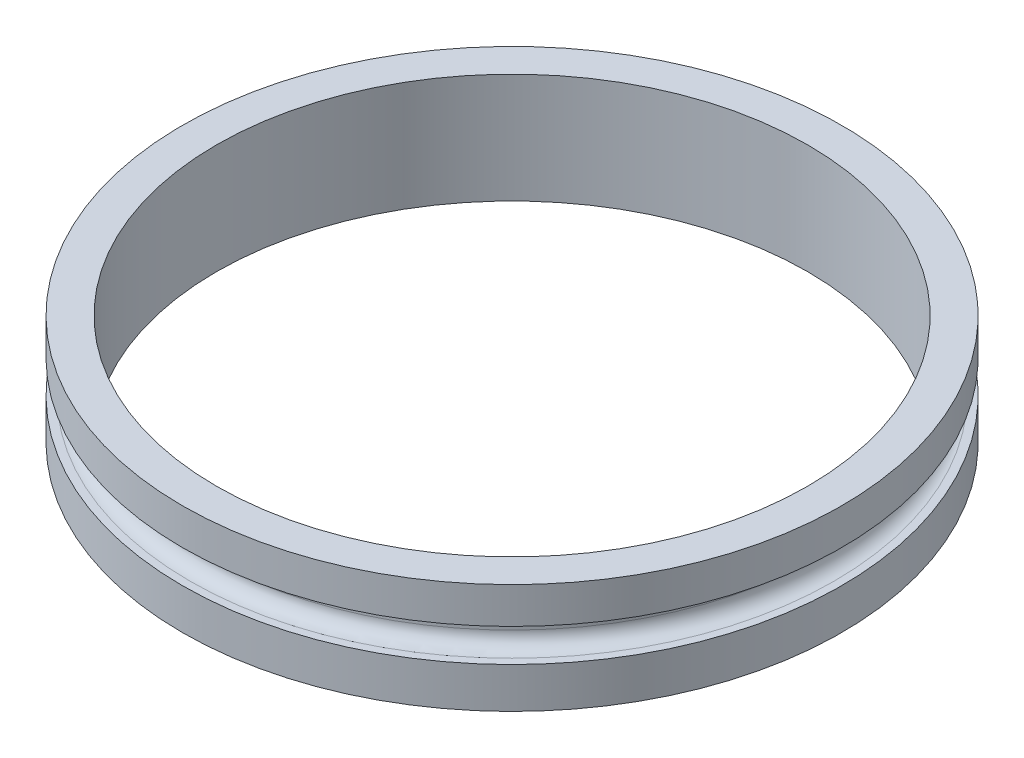
ISO-10303-21;
HEADER;
FILE_DESCRIPTION(('STEP AP214'),'2;1');
FILE_NAME('part.step','',(''),(''),'','','');
FILE_SCHEMA(('AUTOMOTIVE_DESIGN { 1 0 10303 214 1 1 1 1 }'));
ENDSEC;
DATA;
#1=APPLICATION_CONTEXT('core data for automotive mechanical design processes');
#2=APPLICATION_PROTOCOL_DEFINITION('international standard','automotive_design',2000,#1);
#3=PRODUCT_CONTEXT('',#1,'mechanical');
#4=PRODUCT('Part','Part','',(#3));
#5=PRODUCT_RELATED_PRODUCT_CATEGORY('part','',(#4));
#6=PRODUCT_DEFINITION_FORMATION('','',#4);
#7=PRODUCT_DEFINITION_CONTEXT('part definition',#1,'design');
#8=PRODUCT_DEFINITION('design','',#6,#7);
#9=PRODUCT_DEFINITION_SHAPE('','',#8);
#10=(LENGTH_UNIT() NAMED_UNIT(*) SI_UNIT(.MILLI.,.METRE.));
#11=(NAMED_UNIT(*) PLANE_ANGLE_UNIT() SI_UNIT($,.RADIAN.));
#12=(NAMED_UNIT(*) SI_UNIT($,.STERADIAN.) SOLID_ANGLE_UNIT());
#13=UNCERTAINTY_MEASURE_WITH_UNIT(LENGTH_MEASURE(1.E-05),#10,'distance_accuracy_value','');
#14=(GEOMETRIC_REPRESENTATION_CONTEXT(3) GLOBAL_UNCERTAINTY_ASSIGNED_CONTEXT((#13)) GLOBAL_UNIT_ASSIGNED_CONTEXT((#10,
#11,#12)) REPRESENTATION_CONTEXT('',''));
#15=CARTESIAN_POINT('',(0.,0.,0.));
#16=DIRECTION('',(0.,0.,1.));
#17=DIRECTION('',(1.,0.,0.));
#18=AXIS2_PLACEMENT_3D('',#15,#16,#17);
#19=CARTESIAN_POINT('',(38.1,0.,0.));
#20=DIRECTION('',(0.,1.,0.));
#21=DIRECTION('',(0.,0.,1.));
#22=AXIS2_PLACEMENT_3D('',#19,#20,#21);
#23=PLANE('',#22);
#24=CARTESIAN_POINT('',(0.,0.,0.));
#25=DIRECTION('',(0.,1.,0.));
#26=DIRECTION('',(0.,0.,1.));
#27=AXIS2_PLACEMENT_3D('',#24,#25,#26);
#28=CIRCLE('',#27,38.1);
#29=CARTESIAN_POINT('',(0.,0.,38.1));
#30=VERTEX_POINT('',#29);
#31=EDGE_CURVE('E67',#30,#30,#28,.T.);
#32=ORIENTED_EDGE('',*,*,#31,.F.);
#33=EDGE_LOOP('',(#32));
#34=FACE_BOUND('',#33,.T.);
#35=CARTESIAN_POINT('',(0.,0.,0.));
#36=DIRECTION('',(0.,1.,0.));
#37=DIRECTION('',(0.,0.,1.));
#38=AXIS2_PLACEMENT_3D('',#35,#36,#37);
#39=CIRCLE('',#38,34.1757);
#40=CARTESIAN_POINT('',(0.,0.,34.1757));
#41=VERTEX_POINT('',#40);
#42=EDGE_CURVE('E52',#41,#41,#39,.T.);
#43=ORIENTED_EDGE('',*,*,#42,.T.);
#44=EDGE_LOOP('',(#43));
#45=FACE_BOUND('',#44,.T.);
#46=ADVANCED_FACE('F32',(#34,#45),#23,.F.);
#47=CARTESIAN_POINT('',(0.,13.335,0.));
#48=DIRECTION('',(0.,1.,0.));
#49=DIRECTION('',(0.,0.,1.));
#50=AXIS2_PLACEMENT_3D('',#47,#48,#49);
#51=CYLINDRICAL_SURFACE('',#50,34.1757);
#52=ORIENTED_EDGE('',*,*,#42,.F.);
#53=EDGE_LOOP('',(#52));
#54=FACE_BOUND('',#53,.T.);
#55=CARTESIAN_POINT('',(0.,12.7,0.));
#56=DIRECTION('',(0.,1.,0.));
#57=DIRECTION('',(0.,0.,1.));
#58=AXIS2_PLACEMENT_3D('',#55,#56,#57);
#59=CIRCLE('',#58,34.1757);
#60=CARTESIAN_POINT('',(0.,12.7,34.1757));
#61=VERTEX_POINT('',#60);
#62=EDGE_CURVE('E55',#61,#61,#59,.T.);
#63=ORIENTED_EDGE('',*,*,#62,.T.);
#64=EDGE_LOOP('',(#63));
#65=FACE_BOUND('',#64,.T.);
#66=ADVANCED_FACE('F75',(#54,#65),#51,.F.);
#67=CARTESIAN_POINT('',(34.1757,12.7,0.));
#68=DIRECTION('',(0.,-1.,0.));
#69=DIRECTION('',(0.,0.,-1.));
#70=AXIS2_PLACEMENT_3D('',#67,#68,#69);
#71=PLANE('',#70);
#72=ORIENTED_EDGE('',*,*,#62,.F.);
#73=EDGE_LOOP('',(#72));
#74=FACE_BOUND('',#73,.T.);
#75=CARTESIAN_POINT('',(0.,12.7,0.));
#76=DIRECTION('',(0.,1.,0.));
#77=DIRECTION('',(0.,0.,1.));
#78=AXIS2_PLACEMENT_3D('',#75,#76,#77);
#79=CIRCLE('',#78,38.1);
#80=CARTESIAN_POINT('',(0.,12.7,38.1));
#81=VERTEX_POINT('',#80);
#82=EDGE_CURVE('E58',#81,#81,#79,.T.);
#83=ORIENTED_EDGE('',*,*,#82,.T.);
#84=EDGE_LOOP('',(#83));
#85=FACE_BOUND('',#84,.T.);
#86=ADVANCED_FACE('F81',(#74,#85),#71,.F.);
#87=CARTESIAN_POINT('',(0.,13.335,0.));
#88=DIRECTION('',(0.,1.,0.));
#89=DIRECTION('',(0.,0.,1.));
#90=AXIS2_PLACEMENT_3D('',#87,#88,#89);
#91=CYLINDRICAL_SURFACE('',#90,38.1);
#92=ORIENTED_EDGE('',*,*,#82,.F.);
#93=EDGE_LOOP('',(#92));
#94=FACE_BOUND('',#93,.T.);
#95=CARTESIAN_POINT('',(0.,8.509,0.));
#96=DIRECTION('',(0.,1.,0.));
#97=DIRECTION('',(0.,0.,1.));
#98=AXIS2_PLACEMENT_3D('',#95,#96,#97);
#99=CIRCLE('',#98,38.1);
#100=CARTESIAN_POINT('',(0.,8.509,38.1));
#101=VERTEX_POINT('',#100);
#102=EDGE_CURVE('E61',#101,#101,#99,.T.);
#103=ORIENTED_EDGE('',*,*,#102,.T.);
#104=EDGE_LOOP('',(#103));
#105=FACE_BOUND('',#104,.T.);
#106=ADVANCED_FACE('F87',(#94,#105),#91,.T.);
#107=CARTESIAN_POINT('',(38.1,8.509,0.));
#108=DIRECTION('',(0.,1.,0.));
#109=DIRECTION('',(0.,0.,1.));
#110=AXIS2_PLACEMENT_3D('',#107,#108,#109);
#111=PLANE('',#110);
#112=CARTESIAN_POINT('',(0.,8.509,0.));
#113=DIRECTION('',(0.,1.,0.));
#114=DIRECTION('',(0.,0.,1.));
#115=AXIS2_PLACEMENT_3D('',#112,#113,#114);
#116=CIRCLE('',#115,37.211);
#117=CARTESIAN_POINT('',(0.,8.509,37.211));
#118=VERTEX_POINT('',#117);
#119=EDGE_CURVE('E10',#118,#118,#116,.T.);
#120=ORIENTED_EDGE('',*,*,#119,.T.);
#121=EDGE_LOOP('',(#120));
#122=FACE_BOUND('',#121,.T.);
#123=ORIENTED_EDGE('',*,*,#102,.F.);
#124=EDGE_LOOP('',(#123));
#125=FACE_BOUND('',#124,.T.);
#126=ADVANCED_FACE('F93',(#122,#125),#111,.F.);
#127=CARTESIAN_POINT('',(0.,13.335,0.));
#128=DIRECTION('',(0.,1.,0.));
#129=DIRECTION('',(0.,0.,1.));
#130=AXIS2_PLACEMENT_3D('',#127,#128,#129);
#131=CYLINDRICAL_SURFACE('',#130,35.56);
#132=CARTESIAN_POINT('',(0.,6.35,0.));
#133=DIRECTION('',(0.,-1.,0.));
#134=DIRECTION('',(0.,0.,-1.));
#135=AXIS2_PLACEMENT_3D('',#132,#133,#134);
#136=CIRCLE('',#135,35.56);
#137=CARTESIAN_POINT('',(0.,6.35,-35.56));
#138=VERTEX_POINT('',#137);
#139=EDGE_CURVE('E43',#138,#138,#136,.F.);
#140=ORIENTED_EDGE('',*,*,#139,.T.);
#141=EDGE_LOOP('',(#140));
#142=FACE_BOUND('',#141,.T.);
#143=CARTESIAN_POINT('',(0.,6.858,0.));
#144=DIRECTION('',(0.,1.,0.));
#145=DIRECTION('',(0.,0.,1.));
#146=AXIS2_PLACEMENT_3D('',#143,#144,#145);
#147=CIRCLE('',#146,35.56);
#148=CARTESIAN_POINT('',(0.,6.858,35.56));
#149=VERTEX_POINT('',#148);
#150=EDGE_CURVE('E47',#149,#149,#147,.F.);
#151=ORIENTED_EDGE('',*,*,#150,.T.);
#152=EDGE_LOOP('',(#151));
#153=FACE_BOUND('',#152,.T.);
#154=ADVANCED_FACE('F98',(#142,#153),#131,.T.);
#155=CARTESIAN_POINT('',(35.56,4.699,0.));
#156=DIRECTION('',(0.,-1.,0.));
#157=DIRECTION('',(0.,0.,-1.));
#158=AXIS2_PLACEMENT_3D('',#155,#156,#157);
#159=PLANE('',#158);
#160=CARTESIAN_POINT('',(0.,4.699,0.));
#161=DIRECTION('',(0.,-1.,0.));
#162=DIRECTION('',(0.,0.,-1.));
#163=AXIS2_PLACEMENT_3D('',#160,#161,#162);
#164=CIRCLE('',#163,37.211);
#165=CARTESIAN_POINT('',(0.,4.699,-37.211));
#166=VERTEX_POINT('',#165);
#167=EDGE_CURVE('E39',#166,#166,#164,.T.);
#168=ORIENTED_EDGE('',*,*,#167,.T.);
#169=EDGE_LOOP('',(#168));
#170=FACE_BOUND('',#169,.T.);
#171=CARTESIAN_POINT('',(0.,4.699,0.));
#172=DIRECTION('',(0.,1.,0.));
#173=DIRECTION('',(0.,0.,1.));
#174=AXIS2_PLACEMENT_3D('',#171,#172,#173);
#175=CIRCLE('',#174,38.1);
#176=CARTESIAN_POINT('',(0.,4.699,38.1));
#177=VERTEX_POINT('',#176);
#178=EDGE_CURVE('E64',#177,#177,#175,.T.);
#179=ORIENTED_EDGE('',*,*,#178,.T.);
#180=EDGE_LOOP('',(#179));
#181=FACE_BOUND('',#180,.T.);
#182=ADVANCED_FACE('F103',(#170,#181),#159,.F.);
#183=CARTESIAN_POINT('',(0.,13.335,0.));
#184=DIRECTION('',(0.,1.,0.));
#185=DIRECTION('',(0.,0.,1.));
#186=AXIS2_PLACEMENT_3D('',#183,#184,#185);
#187=CYLINDRICAL_SURFACE('',#186,38.1);
#188=ORIENTED_EDGE('',*,*,#178,.F.);
#189=EDGE_LOOP('',(#188));
#190=FACE_BOUND('',#189,.T.);
#191=ORIENTED_EDGE('',*,*,#31,.T.);
#192=EDGE_LOOP('',(#191));
#193=FACE_BOUND('',#192,.T.);
#194=ADVANCED_FACE('F71',(#190,#193),#187,.T.);
#195=CARTESIAN_POINT('',(0.,6.35,0.));
#196=DIRECTION('',(0.,-1.,0.));
#197=DIRECTION('',(0.,0.,-1.));
#198=AXIS2_PLACEMENT_3D('',#195,#196,#197);
#199=TOROIDAL_SURFACE('',#198,37.211,1.651);
#200=ORIENTED_EDGE('',*,*,#167,.F.);
#201=EDGE_LOOP('',(#200));
#202=FACE_BOUND('',#201,.T.);
#203=ORIENTED_EDGE('',*,*,#139,.F.);
#204=EDGE_LOOP('',(#203));
#205=FACE_BOUND('',#204,.T.);
#206=ADVANCED_FACE('F107',(#202,#205),#199,.F.);
#207=CARTESIAN_POINT('',(0.,6.858,0.));
#208=DIRECTION('',(0.,1.,0.));
#209=DIRECTION('',(0.,0.,1.));
#210=AXIS2_PLACEMENT_3D('',#207,#208,#209);
#211=TOROIDAL_SURFACE('',#210,37.211,1.651);
#212=ORIENTED_EDGE('',*,*,#150,.F.);
#213=EDGE_LOOP('',(#212));
#214=FACE_BOUND('',#213,.T.);
#215=ORIENTED_EDGE('',*,*,#119,.F.);
#216=EDGE_LOOP('',(#215));
#217=FACE_BOUND('',#216,.T.);
#218=ADVANCED_FACE('F34',(#214,#217),#211,.F.);
#219=CLOSED_SHELL('',(#46,#66,#86,#106,#126,#154,#182,#194,#206,#218));
#220=MANIFOLD_SOLID_BREP('B2',#219);
#221=ADVANCED_BREP_SHAPE_REPRESENTATION('',(#18,#220),#14);
#222=SHAPE_DEFINITION_REPRESENTATION(#9,#221);
ENDSEC;
END-ISO-10303-21;
